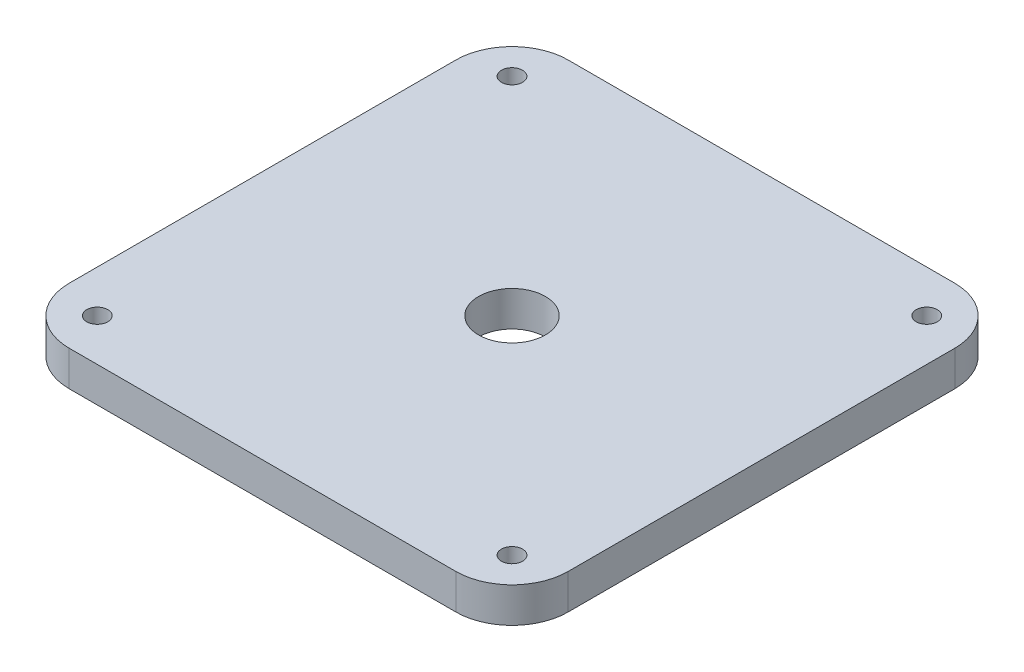
ISO-10303-21;
HEADER;
FILE_DESCRIPTION(('STEP AP214'),'2;1');
FILE_NAME('part.step','',(''),(''),'','','');
FILE_SCHEMA(('AUTOMOTIVE_DESIGN { 1 0 10303 214 1 1 1 1 }'));
ENDSEC;
DATA;
#1=APPLICATION_CONTEXT('core data for automotive mechanical design processes');
#2=APPLICATION_PROTOCOL_DEFINITION('international standard','automotive_design',2000,#1);
#3=PRODUCT_CONTEXT('',#1,'mechanical');
#4=PRODUCT('Part','Part','',(#3));
#5=PRODUCT_RELATED_PRODUCT_CATEGORY('part','',(#4));
#6=PRODUCT_DEFINITION_FORMATION('','',#4);
#7=PRODUCT_DEFINITION_CONTEXT('part definition',#1,'design');
#8=PRODUCT_DEFINITION('design','',#6,#7);
#9=PRODUCT_DEFINITION_SHAPE('','',#8);
#10=(LENGTH_UNIT() NAMED_UNIT(*) SI_UNIT(.MILLI.,.METRE.));
#11=(NAMED_UNIT(*) PLANE_ANGLE_UNIT() SI_UNIT($,.RADIAN.));
#12=(NAMED_UNIT(*) SI_UNIT($,.STERADIAN.) SOLID_ANGLE_UNIT());
#13=UNCERTAINTY_MEASURE_WITH_UNIT(LENGTH_MEASURE(1.E-05),#10,'distance_accuracy_value','');
#14=(GEOMETRIC_REPRESENTATION_CONTEXT(3) GLOBAL_UNCERTAINTY_ASSIGNED_CONTEXT((#13)) GLOBAL_UNIT_ASSIGNED_CONTEXT((#10,
#11,#12)) REPRESENTATION_CONTEXT('',''));
#15=CARTESIAN_POINT('',(0.,0.,0.));
#16=DIRECTION('',(0.,0.,1.));
#17=DIRECTION('',(1.,0.,0.));
#18=AXIS2_PLACEMENT_3D('',#15,#16,#17);
#19=CARTESIAN_POINT('',(0.,5.,0.));
#20=DIRECTION('',(0.,-1.,0.));
#21=DIRECTION('',(0.,0.,-1.));
#22=AXIS2_PLACEMENT_3D('',#19,#20,#21);
#23=PLANE('',#22);
#24=CARTESIAN_POINT('',(6.,5.,-65.));
#25=DIRECTION('',(0.,1.,0.));
#26=DIRECTION('',(0.,0.,1.));
#27=AXIS2_PLACEMENT_3D('',#24,#25,#26);
#28=CIRCLE('',#27,1.5);
#29=CARTESIAN_POINT('',(6.,5.,-63.5));
#30=VERTEX_POINT('',#29);
#31=EDGE_CURVE('E198',#30,#30,#28,.T.);
#32=ORIENTED_EDGE('',*,*,#31,.F.);
#33=EDGE_LOOP('',(#32));
#34=FACE_BOUND('',#33,.T.);
#35=CARTESIAN_POINT('',(65.,5.,-6.));
#36=DIRECTION('',(0.,1.,0.));
#37=DIRECTION('',(0.,0.,1.));
#38=AXIS2_PLACEMENT_3D('',#35,#36,#37);
#39=CIRCLE('',#38,1.5);
#40=CARTESIAN_POINT('',(65.,5.,-4.5));
#41=VERTEX_POINT('',#40);
#42=EDGE_CURVE('E187',#41,#41,#39,.T.);
#43=ORIENTED_EDGE('',*,*,#42,.F.);
#44=EDGE_LOOP('',(#43));
#45=FACE_BOUND('',#44,.T.);
#46=DIRECTION('',(-1.,0.,0.));
#47=VECTOR('',#46,1.);
#48=CARTESIAN_POINT('',(0.,5.,-71.));
#49=LINE('',#48,#47);
#50=CARTESIAN_POINT('',(63.,5.,-71.));
#51=VERTEX_POINT('',#50);
#52=CARTESIAN_POINT('',(8.,5.,-71.));
#53=VERTEX_POINT('',#52);
#54=EDGE_CURVE('E139',#51,#53,#49,.T.);
#55=ORIENTED_EDGE('',*,*,#54,.T.);
#56=CARTESIAN_POINT('',(8.,5.,-63.));
#57=DIRECTION('',(0.,-1.,0.));
#58=DIRECTION('',(0.,0.,-1.));
#59=AXIS2_PLACEMENT_3D('',#56,#57,#58);
#60=CIRCLE('',#59,8.);
#61=CARTESIAN_POINT('',(0.,5.,-63.));
#62=VERTEX_POINT('',#61);
#63=EDGE_CURVE('E157',#53,#62,#60,.F.);
#64=ORIENTED_EDGE('',*,*,#63,.T.);
#65=DIRECTION('',(0.,0.,1.));
#66=VECTOR('',#65,1.);
#67=CARTESIAN_POINT('',(0.,5.,0.));
#68=LINE('',#67,#66);
#69=CARTESIAN_POINT('',(0.,5.,-8.));
#70=VERTEX_POINT('',#69);
#71=EDGE_CURVE('E121',#62,#70,#68,.T.);
#72=ORIENTED_EDGE('',*,*,#71,.T.);
#73=CARTESIAN_POINT('',(8.,5.,-8.));
#74=DIRECTION('',(0.,-1.,0.));
#75=DIRECTION('',(0.,0.,-1.));
#76=AXIS2_PLACEMENT_3D('',#73,#74,#75);
#77=CIRCLE('',#76,8.);
#78=CARTESIAN_POINT('',(8.,5.,0.));
#79=VERTEX_POINT('',#78);
#80=EDGE_CURVE('E153',#70,#79,#77,.F.);
#81=ORIENTED_EDGE('',*,*,#80,.T.);
#82=DIRECTION('',(1.,0.,0.));
#83=VECTOR('',#82,1.);
#84=CARTESIAN_POINT('',(0.,5.,0.));
#85=LINE('',#84,#83);
#86=CARTESIAN_POINT('',(63.,5.,0.));
#87=VERTEX_POINT('',#86);
#88=EDGE_CURVE('E166',#79,#87,#85,.T.);
#89=ORIENTED_EDGE('',*,*,#88,.T.);
#90=CARTESIAN_POINT('',(63.,5.,-8.));
#91=DIRECTION('',(0.,-1.,0.));
#92=DIRECTION('',(0.,0.,-1.));
#93=AXIS2_PLACEMENT_3D('',#90,#91,#92);
#94=CIRCLE('',#93,8.);
#95=CARTESIAN_POINT('',(71.,5.,-8.));
#96=VERTEX_POINT('',#95);
#97=EDGE_CURVE('E56',#87,#96,#94,.F.);
#98=ORIENTED_EDGE('',*,*,#97,.T.);
#99=DIRECTION('',(0.,0.,-1.));
#100=VECTOR('',#99,1.);
#101=CARTESIAN_POINT('',(71.,5.,0.));
#102=LINE('',#101,#100);
#103=CARTESIAN_POINT('',(71.,5.,-63.));
#104=VERTEX_POINT('',#103);
#105=EDGE_CURVE('E172',#96,#104,#102,.T.);
#106=ORIENTED_EDGE('',*,*,#105,.T.);
#107=CARTESIAN_POINT('',(63.,5.,-63.));
#108=DIRECTION('',(0.,-1.,0.));
#109=DIRECTION('',(0.,0.,-1.));
#110=AXIS2_PLACEMENT_3D('',#107,#108,#109);
#111=CIRCLE('',#110,8.);
#112=EDGE_CURVE('E155',#104,#51,#111,.F.);
#113=ORIENTED_EDGE('',*,*,#112,.T.);
#114=EDGE_LOOP('',(#55,#64,#72,#81,#89,#98,#106,#113));
#115=FACE_BOUND('',#114,.T.);
#116=CARTESIAN_POINT('',(6.,5.,-6.));
#117=DIRECTION('',(0.,1.,0.));
#118=DIRECTION('',(0.,0.,1.));
#119=AXIS2_PLACEMENT_3D('',#116,#117,#118);
#120=CIRCLE('',#119,1.5);
#121=CARTESIAN_POINT('',(6.,5.,-4.5));
#122=VERTEX_POINT('',#121);
#123=EDGE_CURVE('E130',#122,#122,#120,.T.);
#124=ORIENTED_EDGE('',*,*,#123,.F.);
#125=EDGE_LOOP('',(#124));
#126=FACE_BOUND('',#125,.T.);
#127=CARTESIAN_POINT('',(65.,5.,-65.));
#128=DIRECTION('',(0.,1.,0.));
#129=DIRECTION('',(0.,0.,1.));
#130=AXIS2_PLACEMENT_3D('',#127,#128,#129);
#131=CIRCLE('',#130,1.5);
#132=CARTESIAN_POINT('',(65.,5.,-63.5));
#133=VERTEX_POINT('',#132);
#134=EDGE_CURVE('E192',#133,#133,#131,.T.);
#135=ORIENTED_EDGE('',*,*,#134,.F.);
#136=EDGE_LOOP('',(#135));
#137=FACE_BOUND('',#136,.T.);
#138=CARTESIAN_POINT('',(35.5,5.,-35.5));
#139=DIRECTION('',(0.,1.,0.));
#140=DIRECTION('',(0.,0.,1.));
#141=AXIS2_PLACEMENT_3D('',#138,#139,#140);
#142=CIRCLE('',#141,4.75);
#143=CARTESIAN_POINT('',(35.5,5.,-30.75));
#144=VERTEX_POINT('',#143);
#145=EDGE_CURVE('E204',#144,#144,#142,.T.);
#146=ORIENTED_EDGE('',*,*,#145,.F.);
#147=EDGE_LOOP('',(#146));
#148=FACE_BOUND('',#147,.T.);
#149=ADVANCED_FACE('F34',(#34,#45,#115,#126,#137,#148),#23,.F.);
#150=CARTESIAN_POINT('',(0.,0.,0.));
#151=DIRECTION('',(0.,-1.,0.));
#152=DIRECTION('',(0.,0.,-1.));
#153=AXIS2_PLACEMENT_3D('',#150,#151,#152);
#154=PLANE('',#153);
#155=CARTESIAN_POINT('',(6.,0.,-65.));
#156=DIRECTION('',(0.,1.,0.));
#157=DIRECTION('',(0.,0.,1.));
#158=AXIS2_PLACEMENT_3D('',#155,#156,#157);
#159=CIRCLE('',#158,1.5);
#160=CARTESIAN_POINT('',(6.,0.,-63.5));
#161=VERTEX_POINT('',#160);
#162=EDGE_CURVE('E201',#161,#161,#159,.T.);
#163=ORIENTED_EDGE('',*,*,#162,.T.);
#164=EDGE_LOOP('',(#163));
#165=FACE_BOUND('',#164,.T.);
#166=CARTESIAN_POINT('',(65.,0.,-6.));
#167=DIRECTION('',(0.,1.,0.));
#168=DIRECTION('',(0.,0.,1.));
#169=AXIS2_PLACEMENT_3D('',#166,#167,#168);
#170=CIRCLE('',#169,1.5);
#171=CARTESIAN_POINT('',(65.,0.,-4.5));
#172=VERTEX_POINT('',#171);
#173=EDGE_CURVE('E189',#172,#172,#170,.T.);
#174=ORIENTED_EDGE('',*,*,#173,.T.);
#175=EDGE_LOOP('',(#174));
#176=FACE_BOUND('',#175,.T.);
#177=DIRECTION('',(0.,0.,1.));
#178=VECTOR('',#177,1.);
#179=CARTESIAN_POINT('',(0.,0.,0.));
#180=LINE('',#179,#178);
#181=CARTESIAN_POINT('',(0.,0.,-63.));
#182=VERTEX_POINT('',#181);
#183=CARTESIAN_POINT('',(0.,0.,-8.));
#184=VERTEX_POINT('',#183);
#185=EDGE_CURVE('E118',#182,#184,#180,.T.);
#186=ORIENTED_EDGE('',*,*,#185,.F.);
#187=CARTESIAN_POINT('',(8.,0.,-63.));
#188=DIRECTION('',(0.,-1.,0.));
#189=DIRECTION('',(0.,0.,-1.));
#190=AXIS2_PLACEMENT_3D('',#187,#188,#189);
#191=CIRCLE('',#190,8.);
#192=CARTESIAN_POINT('',(8.,0.,-71.));
#193=VERTEX_POINT('',#192);
#194=EDGE_CURVE('E101',#182,#193,#191,.T.);
#195=ORIENTED_EDGE('',*,*,#194,.T.);
#196=DIRECTION('',(-1.,0.,0.));
#197=VECTOR('',#196,1.);
#198=CARTESIAN_POINT('',(0.,0.,-71.));
#199=LINE('',#198,#197);
#200=CARTESIAN_POINT('',(63.,0.,-71.));
#201=VERTEX_POINT('',#200);
#202=EDGE_CURVE('E143',#201,#193,#199,.T.);
#203=ORIENTED_EDGE('',*,*,#202,.F.);
#204=CARTESIAN_POINT('',(63.,0.,-63.));
#205=DIRECTION('',(0.,-1.,0.));
#206=DIRECTION('',(0.,0.,-1.));
#207=AXIS2_PLACEMENT_3D('',#204,#205,#206);
#208=CIRCLE('',#207,8.);
#209=CARTESIAN_POINT('',(71.,0.,-63.));
#210=VERTEX_POINT('',#209);
#211=EDGE_CURVE('E112',#201,#210,#208,.T.);
#212=ORIENTED_EDGE('',*,*,#211,.T.);
#213=DIRECTION('',(0.,0.,-1.));
#214=VECTOR('',#213,1.);
#215=CARTESIAN_POINT('',(71.,0.,0.));
#216=LINE('',#215,#214);
#217=CARTESIAN_POINT('',(71.,0.,-8.));
#218=VERTEX_POINT('',#217);
#219=EDGE_CURVE('E133',#218,#210,#216,.T.);
#220=ORIENTED_EDGE('',*,*,#219,.F.);
#221=CARTESIAN_POINT('',(63.,0.,-8.));
#222=DIRECTION('',(0.,-1.,0.));
#223=DIRECTION('',(0.,0.,-1.));
#224=AXIS2_PLACEMENT_3D('',#221,#222,#223);
#225=CIRCLE('',#224,8.);
#226=CARTESIAN_POINT('',(63.,0.,0.));
#227=VERTEX_POINT('',#226);
#228=EDGE_CURVE('E122',#218,#227,#225,.T.);
#229=ORIENTED_EDGE('',*,*,#228,.T.);
#230=DIRECTION('',(1.,0.,0.));
#231=VECTOR('',#230,1.);
#232=CARTESIAN_POINT('',(0.,0.,0.));
#233=LINE('',#232,#231);
#234=CARTESIAN_POINT('',(8.,0.,0.));
#235=VERTEX_POINT('',#234);
#236=EDGE_CURVE('E129',#235,#227,#233,.T.);
#237=ORIENTED_EDGE('',*,*,#236,.F.);
#238=CARTESIAN_POINT('',(8.,0.,-8.));
#239=DIRECTION('',(0.,-1.,0.));
#240=DIRECTION('',(0.,0.,-1.));
#241=AXIS2_PLACEMENT_3D('',#238,#239,#240);
#242=CIRCLE('',#241,8.);
#243=EDGE_CURVE('E128',#235,#184,#242,.T.);
#244=ORIENTED_EDGE('',*,*,#243,.T.);
#245=EDGE_LOOP('',(#186,#195,#203,#212,#220,#229,#237,#244));
#246=FACE_BOUND('',#245,.T.);
#247=CARTESIAN_POINT('',(6.,0.,-6.));
#248=DIRECTION('',(0.,1.,0.));
#249=DIRECTION('',(0.,0.,1.));
#250=AXIS2_PLACEMENT_3D('',#247,#248,#249);
#251=CIRCLE('',#250,1.5);
#252=CARTESIAN_POINT('',(6.,0.,-4.5));
#253=VERTEX_POINT('',#252);
#254=EDGE_CURVE('E136',#253,#253,#251,.T.);
#255=ORIENTED_EDGE('',*,*,#254,.T.);
#256=EDGE_LOOP('',(#255));
#257=FACE_BOUND('',#256,.T.);
#258=CARTESIAN_POINT('',(65.,0.,-65.));
#259=DIRECTION('',(0.,1.,0.));
#260=DIRECTION('',(0.,0.,1.));
#261=AXIS2_PLACEMENT_3D('',#258,#259,#260);
#262=CIRCLE('',#261,1.5);
#263=CARTESIAN_POINT('',(65.,0.,-63.5));
#264=VERTEX_POINT('',#263);
#265=EDGE_CURVE('E195',#264,#264,#262,.T.);
#266=ORIENTED_EDGE('',*,*,#265,.T.);
#267=EDGE_LOOP('',(#266));
#268=FACE_BOUND('',#267,.T.);
#269=CARTESIAN_POINT('',(35.5,0.,-35.5));
#270=DIRECTION('',(0.,1.,0.));
#271=DIRECTION('',(0.,0.,1.));
#272=AXIS2_PLACEMENT_3D('',#269,#270,#271);
#273=CIRCLE('',#272,4.75);
#274=CARTESIAN_POINT('',(35.5,0.,-30.75));
#275=VERTEX_POINT('',#274);
#276=EDGE_CURVE('E207',#275,#275,#273,.T.);
#277=ORIENTED_EDGE('',*,*,#276,.T.);
#278=EDGE_LOOP('',(#277));
#279=FACE_BOUND('',#278,.T.);
#280=ADVANCED_FACE('F125',(#165,#176,#246,#257,#268,#279),#154,.T.);
#281=CARTESIAN_POINT('',(0.,5.,0.));
#282=DIRECTION('',(1.,0.,0.));
#283=DIRECTION('',(0.,0.,-1.));
#284=AXIS2_PLACEMENT_3D('',#281,#282,#283);
#285=PLANE('',#284);
#286=ORIENTED_EDGE('',*,*,#71,.F.);
#287=DIRECTION('',(0.,-1.,0.));
#288=VECTOR('',#287,1.);
#289=CARTESIAN_POINT('',(0.,5.,-63.));
#290=LINE('',#289,#288);
#291=EDGE_CURVE('E105',#62,#182,#290,.T.);
#292=ORIENTED_EDGE('',*,*,#291,.T.);
#293=ORIENTED_EDGE('',*,*,#185,.T.);
#294=DIRECTION('',(0.,-1.,0.));
#295=VECTOR('',#294,1.);
#296=CARTESIAN_POINT('',(0.,5.,-8.));
#297=LINE('',#296,#295);
#298=EDGE_CURVE('E123',#184,#70,#297,.F.);
#299=ORIENTED_EDGE('',*,*,#298,.T.);
#300=EDGE_LOOP('',(#286,#292,#293,#299));
#301=FACE_BOUND('',#300,.T.);
#302=ADVANCED_FACE('F117',(#301),#285,.F.);
#303=CARTESIAN_POINT('',(0.,5.,0.));
#304=DIRECTION('',(0.,0.,-1.));
#305=DIRECTION('',(-1.,0.,0.));
#306=AXIS2_PLACEMENT_3D('',#303,#304,#305);
#307=PLANE('',#306);
#308=ORIENTED_EDGE('',*,*,#88,.F.);
#309=DIRECTION('',(0.,-1.,0.));
#310=VECTOR('',#309,1.);
#311=CARTESIAN_POINT('',(8.,5.,0.));
#312=LINE('',#311,#310);
#313=EDGE_CURVE('E11',#79,#235,#312,.T.);
#314=ORIENTED_EDGE('',*,*,#313,.T.);
#315=ORIENTED_EDGE('',*,*,#236,.T.);
#316=DIRECTION('',(0.,-1.,0.));
#317=VECTOR('',#316,1.);
#318=CARTESIAN_POINT('',(63.,5.,0.));
#319=LINE('',#318,#317);
#320=EDGE_CURVE('E42',#227,#87,#319,.F.);
#321=ORIENTED_EDGE('',*,*,#320,.T.);
#322=EDGE_LOOP('',(#308,#314,#315,#321));
#323=FACE_BOUND('',#322,.T.);
#324=ADVANCED_FACE('F165',(#323),#307,.F.);
#325=CARTESIAN_POINT('',(71.,5.,0.));
#326=DIRECTION('',(-1.,0.,0.));
#327=DIRECTION('',(0.,0.,1.));
#328=AXIS2_PLACEMENT_3D('',#325,#326,#327);
#329=PLANE('',#328);
#330=ORIENTED_EDGE('',*,*,#219,.T.);
#331=DIRECTION('',(0.,-1.,0.));
#332=VECTOR('',#331,1.);
#333=CARTESIAN_POINT('',(71.,5.,-63.));
#334=LINE('',#333,#332);
#335=EDGE_CURVE('E49',#210,#104,#334,.F.);
#336=ORIENTED_EDGE('',*,*,#335,.T.);
#337=ORIENTED_EDGE('',*,*,#105,.F.);
#338=DIRECTION('',(0.,-1.,0.));
#339=VECTOR('',#338,1.);
#340=CARTESIAN_POINT('',(71.,5.,-8.));
#341=LINE('',#340,#339);
#342=EDGE_CURVE('E159',#96,#218,#341,.T.);
#343=ORIENTED_EDGE('',*,*,#342,.T.);
#344=EDGE_LOOP('',(#330,#336,#337,#343));
#345=FACE_BOUND('',#344,.T.);
#346=ADVANCED_FACE('F176',(#345),#329,.F.);
#347=CARTESIAN_POINT('',(0.,5.,-71.));
#348=DIRECTION('',(0.,0.,1.));
#349=DIRECTION('',(1.,0.,0.));
#350=AXIS2_PLACEMENT_3D('',#347,#348,#349);
#351=PLANE('',#350);
#352=ORIENTED_EDGE('',*,*,#202,.T.);
#353=DIRECTION('',(0.,-1.,0.));
#354=VECTOR('',#353,1.);
#355=CARTESIAN_POINT('',(8.,5.,-71.));
#356=LINE('',#355,#354);
#357=EDGE_CURVE('E106',#193,#53,#356,.F.);
#358=ORIENTED_EDGE('',*,*,#357,.T.);
#359=ORIENTED_EDGE('',*,*,#54,.F.);
#360=DIRECTION('',(0.,-1.,0.));
#361=VECTOR('',#360,1.);
#362=CARTESIAN_POINT('',(63.,5.,-71.));
#363=LINE('',#362,#361);
#364=EDGE_CURVE('E111',#51,#201,#363,.T.);
#365=ORIENTED_EDGE('',*,*,#364,.T.);
#366=EDGE_LOOP('',(#352,#358,#359,#365));
#367=FACE_BOUND('',#366,.T.);
#368=ADVANCED_FACE('F183',(#367),#351,.F.);
#369=CARTESIAN_POINT('',(6.,5.,-6.));
#370=DIRECTION('',(0.,-1.,0.));
#371=DIRECTION('',(0.,0.,-1.));
#372=AXIS2_PLACEMENT_3D('',#369,#370,#371);
#373=CYLINDRICAL_SURFACE('',#372,1.5);
#374=ORIENTED_EDGE('',*,*,#123,.T.);
#375=EDGE_LOOP('',(#374));
#376=FACE_BOUND('',#375,.T.);
#377=ORIENTED_EDGE('',*,*,#254,.F.);
#378=EDGE_LOOP('',(#377));
#379=FACE_BOUND('',#378,.T.);
#380=ADVANCED_FACE('F227',(#376,#379),#373,.F.);
#381=CARTESIAN_POINT('',(65.,5.,-6.));
#382=DIRECTION('',(0.,-1.,0.));
#383=DIRECTION('',(0.,0.,-1.));
#384=AXIS2_PLACEMENT_3D('',#381,#382,#383);
#385=CYLINDRICAL_SURFACE('',#384,1.5);
#386=ORIENTED_EDGE('',*,*,#42,.T.);
#387=EDGE_LOOP('',(#386));
#388=FACE_BOUND('',#387,.T.);
#389=ORIENTED_EDGE('',*,*,#173,.F.);
#390=EDGE_LOOP('',(#389));
#391=FACE_BOUND('',#390,.T.);
#392=ADVANCED_FACE('F329',(#388,#391),#385,.F.);
#393=CARTESIAN_POINT('',(65.,5.,-65.));
#394=DIRECTION('',(0.,-1.,0.));
#395=DIRECTION('',(0.,0.,-1.));
#396=AXIS2_PLACEMENT_3D('',#393,#394,#395);
#397=CYLINDRICAL_SURFACE('',#396,1.5);
#398=ORIENTED_EDGE('',*,*,#134,.T.);
#399=EDGE_LOOP('',(#398));
#400=FACE_BOUND('',#399,.T.);
#401=ORIENTED_EDGE('',*,*,#265,.F.);
#402=EDGE_LOOP('',(#401));
#403=FACE_BOUND('',#402,.T.);
#404=ADVANCED_FACE('F319',(#400,#403),#397,.F.);
#405=CARTESIAN_POINT('',(6.,5.,-65.));
#406=DIRECTION('',(0.,-1.,0.));
#407=DIRECTION('',(0.,0.,-1.));
#408=AXIS2_PLACEMENT_3D('',#405,#406,#407);
#409=CYLINDRICAL_SURFACE('',#408,1.5);
#410=ORIENTED_EDGE('',*,*,#31,.T.);
#411=EDGE_LOOP('',(#410));
#412=FACE_BOUND('',#411,.T.);
#413=ORIENTED_EDGE('',*,*,#162,.F.);
#414=EDGE_LOOP('',(#413));
#415=FACE_BOUND('',#414,.T.);
#416=ADVANCED_FACE('F310',(#412,#415),#409,.F.);
#417=CARTESIAN_POINT('',(35.5,5.,-35.5));
#418=DIRECTION('',(0.,-1.,0.));
#419=DIRECTION('',(0.,0.,-1.));
#420=AXIS2_PLACEMENT_3D('',#417,#418,#419);
#421=CYLINDRICAL_SURFACE('',#420,4.75);
#422=ORIENTED_EDGE('',*,*,#145,.T.);
#423=EDGE_LOOP('',(#422));
#424=FACE_BOUND('',#423,.T.);
#425=ORIENTED_EDGE('',*,*,#276,.F.);
#426=EDGE_LOOP('',(#425));
#427=FACE_BOUND('',#426,.T.);
#428=ADVANCED_FACE('F213',(#424,#427),#421,.F.);
#429=CARTESIAN_POINT('',(8.,5.,-63.));
#430=DIRECTION('',(0.,-1.,0.));
#431=DIRECTION('',(0.,0.,-1.));
#432=AXIS2_PLACEMENT_3D('',#429,#430,#431);
#433=CYLINDRICAL_SURFACE('',#432,8.);
#434=ORIENTED_EDGE('',*,*,#63,.F.);
#435=ORIENTED_EDGE('',*,*,#357,.F.);
#436=ORIENTED_EDGE('',*,*,#194,.F.);
#437=ORIENTED_EDGE('',*,*,#291,.F.);
#438=EDGE_LOOP('',(#434,#435,#436,#437));
#439=FACE_BOUND('',#438,.T.);
#440=ADVANCED_FACE('F104',(#439),#433,.T.);
#441=CARTESIAN_POINT('',(63.,5.,-63.));
#442=DIRECTION('',(0.,-1.,0.));
#443=DIRECTION('',(0.,0.,-1.));
#444=AXIS2_PLACEMENT_3D('',#441,#442,#443);
#445=CYLINDRICAL_SURFACE('',#444,8.);
#446=ORIENTED_EDGE('',*,*,#112,.F.);
#447=ORIENTED_EDGE('',*,*,#335,.F.);
#448=ORIENTED_EDGE('',*,*,#211,.F.);
#449=ORIENTED_EDGE('',*,*,#364,.F.);
#450=EDGE_LOOP('',(#446,#447,#448,#449));
#451=FACE_BOUND('',#450,.T.);
#452=ADVANCED_FACE('F180',(#451),#445,.T.);
#453=CARTESIAN_POINT('',(8.,5.,-8.));
#454=DIRECTION('',(0.,-1.,0.));
#455=DIRECTION('',(0.,0.,-1.));
#456=AXIS2_PLACEMENT_3D('',#453,#454,#455);
#457=CYLINDRICAL_SURFACE('',#456,8.);
#458=ORIENTED_EDGE('',*,*,#80,.F.);
#459=ORIENTED_EDGE('',*,*,#298,.F.);
#460=ORIENTED_EDGE('',*,*,#243,.F.);
#461=ORIENTED_EDGE('',*,*,#313,.F.);
#462=EDGE_LOOP('',(#458,#459,#460,#461));
#463=FACE_BOUND('',#462,.T.);
#464=ADVANCED_FACE('F241',(#463),#457,.T.);
#465=CARTESIAN_POINT('',(63.,5.,-8.));
#466=DIRECTION('',(0.,-1.,0.));
#467=DIRECTION('',(0.,0.,-1.));
#468=AXIS2_PLACEMENT_3D('',#465,#466,#467);
#469=CYLINDRICAL_SURFACE('',#468,8.);
#470=ORIENTED_EDGE('',*,*,#97,.F.);
#471=ORIENTED_EDGE('',*,*,#320,.F.);
#472=ORIENTED_EDGE('',*,*,#228,.F.);
#473=ORIENTED_EDGE('',*,*,#342,.F.);
#474=EDGE_LOOP('',(#470,#471,#472,#473));
#475=FACE_BOUND('',#474,.T.);
#476=ADVANCED_FACE('F36',(#475),#469,.T.);
#477=CLOSED_SHELL('',(#149,#280,#302,#324,#346,#368,#380,#392,#404,#416,#428,#440,#452,#464,#476));
#478=MANIFOLD_SOLID_BREP('B2',#477);
#479=ADVANCED_BREP_SHAPE_REPRESENTATION('',(#18,#478),#14);
#480=SHAPE_DEFINITION_REPRESENTATION(#9,#479);
ENDSEC;
END-ISO-10303-21;
